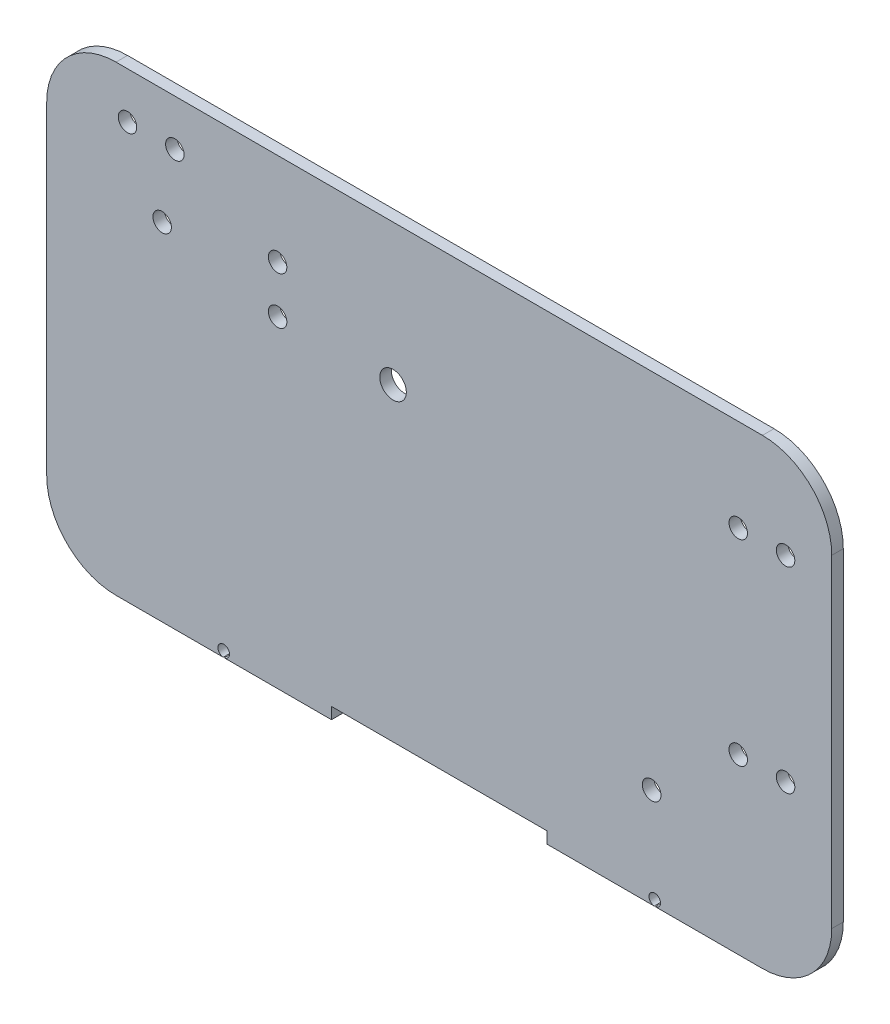
ISO-10303-21;
HEADER;
FILE_DESCRIPTION(('STEP AP214'),'2;1');
FILE_NAME('part.step','',(''),(''),'','','');
FILE_SCHEMA(('AUTOMOTIVE_DESIGN { 1 0 10303 214 1 1 1 1 }'));
ENDSEC;
DATA;
#1=APPLICATION_CONTEXT('core data for automotive mechanical design processes');
#2=APPLICATION_PROTOCOL_DEFINITION('international standard','automotive_design',2000,#1);
#3=PRODUCT_CONTEXT('',#1,'mechanical');
#4=PRODUCT('Part','Part','',(#3));
#5=PRODUCT_RELATED_PRODUCT_CATEGORY('part','',(#4));
#6=PRODUCT_DEFINITION_FORMATION('','',#4);
#7=PRODUCT_DEFINITION_CONTEXT('part definition',#1,'design');
#8=PRODUCT_DEFINITION('design','',#6,#7);
#9=PRODUCT_DEFINITION_SHAPE('','',#8);
#10=(LENGTH_UNIT() NAMED_UNIT(*) SI_UNIT(.MILLI.,.METRE.));
#11=(NAMED_UNIT(*) PLANE_ANGLE_UNIT() SI_UNIT($,.RADIAN.));
#12=(NAMED_UNIT(*) SI_UNIT($,.STERADIAN.) SOLID_ANGLE_UNIT());
#13=UNCERTAINTY_MEASURE_WITH_UNIT(LENGTH_MEASURE(1.E-05),#10,'distance_accuracy_value','');
#14=(GEOMETRIC_REPRESENTATION_CONTEXT(3) GLOBAL_UNCERTAINTY_ASSIGNED_CONTEXT((#13)) GLOBAL_UNIT_ASSIGNED_CONTEXT((#10,
#11,#12)) REPRESENTATION_CONTEXT('',''));
#15=CARTESIAN_POINT('',(0.,0.,0.));
#16=DIRECTION('',(0.,0.,1.));
#17=DIRECTION('',(1.,0.,0.));
#18=AXIS2_PLACEMENT_3D('',#15,#16,#17);
#19=CARTESIAN_POINT('',(-125.47242970477,-88.332065652522,5.));
#20=DIRECTION('',(0.,1.,0.));
#21=DIRECTION('',(0.,0.,1.));
#22=AXIS2_PLACEMENT_3D('',#19,#20,#21);
#23=PLANE('',#22);
#24=DIRECTION('',(1.,0.,0.));
#25=VECTOR('',#24,1.);
#26=CARTESIAN_POINT('',(-125.47242970477,-88.332065652522,0.));
#27=LINE('',#26,#25);
#28=CARTESIAN_POINT('',(61.1942369618966,-88.332065652522,0.));
#29=VERTEX_POINT('',#28);
#30=CARTESIAN_POINT('',(107.637520549526,-88.332065652522,0.));
#31=VERTEX_POINT('',#30);
#32=EDGE_CURVE('E157',#29,#31,#27,.T.);
#33=ORIENTED_EDGE('',*,*,#32,.T.);
#34=DIRECTION('',(0.,0.,1.));
#35=VECTOR('',#34,1.);
#36=CARTESIAN_POINT('',(107.637520549526,-88.332065652522,-5.));
#37=LINE('',#36,#35);
#38=CARTESIAN_POINT('',(107.637520549526,-88.332065652522,5.));
#39=VERTEX_POINT('',#38);
#40=EDGE_CURVE('E11',#31,#39,#37,.T.);
#41=ORIENTED_EDGE('',*,*,#40,.T.);
#42=DIRECTION('',(1.,0.,0.));
#43=VECTOR('',#42,1.);
#44=CARTESIAN_POINT('',(-125.47242970477,-88.332065652522,5.));
#45=LINE('',#44,#43);
#46=CARTESIAN_POINT('',(61.1942369618966,-88.332065652522,5.));
#47=VERTEX_POINT('',#46);
#48=EDGE_CURVE('E155',#47,#39,#45,.T.);
#49=ORIENTED_EDGE('',*,*,#48,.F.);
#50=DIRECTION('',(0.,0.,1.));
#51=VECTOR('',#50,1.);
#52=CARTESIAN_POINT('',(61.1942369618966,-88.332065652522,5.));
#53=LINE('',#52,#51);
#54=EDGE_CURVE('E236',#29,#47,#53,.T.);
#55=ORIENTED_EDGE('',*,*,#54,.F.);
#56=EDGE_LOOP('',(#33,#41,#49,#55));
#57=FACE_BOUND('',#56,.T.);
#58=ADVANCED_FACE('F34',(#57),#23,.F.);
#59=CARTESIAN_POINT('',(-125.47242970477,-88.332065652522,0.));
#60=VERTEX_POINT('',#59);
#61=CARTESIAN_POINT('',(-79.02914611714,-88.332065652522,0.));
#62=VERTEX_POINT('',#61);
#63=EDGE_CURVE('E194',#60,#62,#27,.T.);
#64=ORIENTED_EDGE('',*,*,#63,.T.);
#65=DIRECTION('',(0.,0.,1.));
#66=VECTOR('',#65,1.);
#67=CARTESIAN_POINT('',(-79.02914611714,-88.332065652522,-5.));
#68=LINE('',#67,#66);
#69=CARTESIAN_POINT('',(-79.02914611714,-88.332065652522,5.));
#70=VERTEX_POINT('',#69);
#71=EDGE_CURVE('E242',#62,#70,#68,.T.);
#72=ORIENTED_EDGE('',*,*,#71,.T.);
#73=CARTESIAN_POINT('',(-125.47242970477,-88.332065652522,5.));
#74=VERTEX_POINT('',#73);
#75=EDGE_CURVE('E167',#74,#70,#45,.T.);
#76=ORIENTED_EDGE('',*,*,#75,.F.);
#77=DIRECTION('',(0.,0.,-1.));
#78=VECTOR('',#77,1.);
#79=CARTESIAN_POINT('',(-125.47242970477,-88.332065652522,5.));
#80=LINE('',#79,#78);
#81=EDGE_CURVE('E230',#74,#60,#80,.T.);
#82=ORIENTED_EDGE('',*,*,#81,.T.);
#83=EDGE_LOOP('',(#64,#72,#76,#82));
#84=FACE_BOUND('',#83,.T.);
#85=ADVANCED_FACE('F346',(#84),#23,.F.);
#86=CARTESIAN_POINT('',(-125.47242970477,-58.332065652522,5.));
#87=DIRECTION('',(0.,0.,1.));
#88=DIRECTION('',(1.,0.,0.));
#89=AXIS2_PLACEMENT_3D('',#86,#87,#88);
#90=PLANE('',#89);
#91=CARTESIAN_POINT('',(107.860903628563,-85.842065652522,5.));
#92=DIRECTION('',(0.,0.,1.));
#93=DIRECTION('',(-1.,0.,0.));
#94=AXIS2_PLACEMENT_3D('',#91,#92,#93);
#95=CIRCLE('',#94,2.5);
#96=CARTESIAN_POINT('',(108.0842867076,-88.332065652522,5.));
#97=VERTEX_POINT('',#96);
#98=EDGE_CURVE('E145',#97,#39,#95,.T.);
#99=ORIENTED_EDGE('',*,*,#98,.F.);
#100=CARTESIAN_POINT('',(154.52757029523,-88.332065652522,5.));
#101=VERTEX_POINT('',#100);
#102=EDGE_CURVE('E165',#97,#101,#45,.T.);
#103=ORIENTED_EDGE('',*,*,#102,.T.);
#104=CARTESIAN_POINT('',(154.52757029523,-58.332065652522,5.));
#105=DIRECTION('',(0.,0.,1.));
#106=DIRECTION('',(1.,0.,0.));
#107=AXIS2_PLACEMENT_3D('',#104,#105,#106);
#108=CIRCLE('',#107,30.);
#109=CARTESIAN_POINT('',(184.52757029523,-58.332065652522,5.));
#110=VERTEX_POINT('',#109);
#111=EDGE_CURVE('E172',#101,#110,#108,.T.);
#112=ORIENTED_EDGE('',*,*,#111,.T.);
#113=DIRECTION('',(0.,1.,0.));
#114=VECTOR('',#113,1.);
#115=CARTESIAN_POINT('',(184.52757029523,-58.332065652522,5.));
#116=LINE('',#115,#114);
#117=CARTESIAN_POINT('',(184.52757029523,81.667934347478,5.));
#118=VERTEX_POINT('',#117);
#119=EDGE_CURVE('E175',#110,#118,#116,.T.);
#120=ORIENTED_EDGE('',*,*,#119,.T.);
#121=CARTESIAN_POINT('',(154.52757029523,81.667934347478,5.));
#122=DIRECTION('',(0.,0.,1.));
#123=DIRECTION('',(1.,0.,0.));
#124=AXIS2_PLACEMENT_3D('',#121,#122,#123);
#125=CIRCLE('',#124,30.);
#126=CARTESIAN_POINT('',(154.52757029523,111.667934347478,5.));
#127=VERTEX_POINT('',#126);
#128=EDGE_CURVE('E178',#118,#127,#125,.T.);
#129=ORIENTED_EDGE('',*,*,#128,.T.);
#130=DIRECTION('',(-1.,0.,0.));
#131=VECTOR('',#130,1.);
#132=CARTESIAN_POINT('',(154.52757029523,111.667934347478,5.));
#133=LINE('',#132,#131);
#134=CARTESIAN_POINT('',(-125.47242970477,111.667934347478,5.));
#135=VERTEX_POINT('',#134);
#136=EDGE_CURVE('E182',#127,#135,#133,.T.);
#137=ORIENTED_EDGE('',*,*,#136,.T.);
#138=CARTESIAN_POINT('',(-125.47242970477,81.667934347478,5.));
#139=DIRECTION('',(0.,0.,1.));
#140=DIRECTION('',(1.,0.,0.));
#141=AXIS2_PLACEMENT_3D('',#138,#139,#140);
#142=CIRCLE('',#141,30.);
#143=CARTESIAN_POINT('',(-155.47242970477,81.667934347478,5.));
#144=VERTEX_POINT('',#143);
#145=EDGE_CURVE('E184',#135,#144,#142,.T.);
#146=ORIENTED_EDGE('',*,*,#145,.T.);
#147=DIRECTION('',(0.,-1.,0.));
#148=VECTOR('',#147,1.);
#149=CARTESIAN_POINT('',(-155.47242970477,81.667934347478,5.));
#150=LINE('',#149,#148);
#151=CARTESIAN_POINT('',(-155.47242970477,-58.3320656525218,5.));
#152=VERTEX_POINT('',#151);
#153=EDGE_CURVE('E186',#144,#152,#150,.T.);
#154=ORIENTED_EDGE('',*,*,#153,.T.);
#155=CARTESIAN_POINT('',(-125.47242970477,-58.332065652522,5.));
#156=DIRECTION('',(0.,0.,1.));
#157=DIRECTION('',(1.,0.,0.));
#158=AXIS2_PLACEMENT_3D('',#155,#156,#157);
#159=CIRCLE('',#158,30.);
#160=EDGE_CURVE('E168',#152,#74,#159,.T.);
#161=ORIENTED_EDGE('',*,*,#160,.T.);
#162=ORIENTED_EDGE('',*,*,#75,.T.);
#163=CARTESIAN_POINT('',(-78.8057630381032,-85.842065652522,5.));
#164=DIRECTION('',(0.,0.,1.));
#165=DIRECTION('',(1.,0.,0.));
#166=AXIS2_PLACEMENT_3D('',#163,#164,#165);
#167=CIRCLE('',#166,2.5);
#168=CARTESIAN_POINT('',(-78.5823799590665,-88.332065652522,5.));
#169=VERTEX_POINT('',#168);
#170=EDGE_CURVE('E348',#169,#70,#167,.T.);
#171=ORIENTED_EDGE('',*,*,#170,.F.);
#172=CARTESIAN_POINT('',(-32.1390963714366,-88.332065652522,5.));
#173=VERTEX_POINT('',#172);
#174=EDGE_CURVE('E164',#169,#173,#45,.T.);
#175=ORIENTED_EDGE('',*,*,#174,.T.);
#176=DIRECTION('',(0.,-1.,0.));
#177=VECTOR('',#176,1.);
#178=CARTESIAN_POINT('',(-32.1390963714366,0.,5.));
#179=LINE('',#178,#177);
#180=CARTESIAN_POINT('',(-32.1390963714366,-83.332065652522,5.));
#181=VERTEX_POINT('',#180);
#182=EDGE_CURVE('E264',#181,#173,#179,.T.);
#183=ORIENTED_EDGE('',*,*,#182,.F.);
#184=DIRECTION('',(1.,0.,0.));
#185=VECTOR('',#184,1.);
#186=CARTESIAN_POINT('',(0.,-83.332065652522,5.));
#187=LINE('',#186,#185);
#188=CARTESIAN_POINT('',(61.1942369618966,-83.332065652522,5.));
#189=VERTEX_POINT('',#188);
#190=EDGE_CURVE('E350',#181,#189,#187,.T.);
#191=ORIENTED_EDGE('',*,*,#190,.T.);
#192=DIRECTION('',(0.,-1.,0.));
#193=VECTOR('',#192,1.);
#194=CARTESIAN_POINT('',(61.1942369618966,0.,5.));
#195=LINE('',#194,#193);
#196=EDGE_CURVE('E163',#189,#47,#195,.T.);
#197=ORIENTED_EDGE('',*,*,#196,.T.);
#198=ORIENTED_EDGE('',*,*,#48,.T.);
#199=EDGE_LOOP('',(#99,#103,#112,#120,#129,#137,#146,#154,#161,#162,#171,#175,#183,#191,#197,#198));
#200=FACE_BOUND('',#199,.T.);
#201=CARTESIAN_POINT('',(-5.47242970477013,50.667934347478,5.));
#202=DIRECTION('',(0.,0.,1.));
#203=DIRECTION('',(1.,0.,0.));
#204=AXIS2_PLACEMENT_3D('',#201,#202,#203);
#205=CIRCLE('',#204,5.75);
#206=CARTESIAN_POINT('',(0.27757029522987,50.667934347478,5.));
#207=VERTEX_POINT('',#206);
#208=EDGE_CURVE('E282',#207,#207,#205,.T.);
#209=ORIENTED_EDGE('',*,*,#208,.F.);
#210=EDGE_LOOP('',(#209));
#211=FACE_BOUND('',#210,.T.);
#212=CARTESIAN_POINT('',(-99.9724297047701,91.667934347478,5.));
#213=DIRECTION('',(0.,0.,1.));
#214=DIRECTION('',(1.,0.,0.));
#215=AXIS2_PLACEMENT_3D('',#212,#213,#214);
#216=CIRCLE('',#215,3.99999999999999);
#217=CARTESIAN_POINT('',(-95.9724297047701,91.667934347478,5.));
#218=VERTEX_POINT('',#217);
#219=EDGE_CURVE('E294',#218,#218,#216,.T.);
#220=ORIENTED_EDGE('',*,*,#219,.F.);
#221=EDGE_LOOP('',(#220));
#222=FACE_BOUND('',#221,.T.);
#223=CARTESIAN_POINT('',(144.02757029523,71.667934347478,5.));
#224=DIRECTION('',(0.,0.,1.));
#225=DIRECTION('',(1.,0.,0.));
#226=AXIS2_PLACEMENT_3D('',#223,#224,#225);
#227=CIRCLE('',#226,3.99999999999999);
#228=CARTESIAN_POINT('',(148.02757029523,71.667934347478,5.));
#229=VERTEX_POINT('',#228);
#230=EDGE_CURVE('E306',#229,#229,#227,.T.);
#231=ORIENTED_EDGE('',*,*,#230,.F.);
#232=EDGE_LOOP('',(#231));
#233=FACE_BOUND('',#232,.T.);
#234=CARTESIAN_POINT('',(144.02757029523,-13.332065652522,5.));
#235=DIRECTION('',(0.,0.,1.));
#236=DIRECTION('',(1.,0.,0.));
#237=AXIS2_PLACEMENT_3D('',#234,#235,#236);
#238=CIRCLE('',#237,3.99999999999999);
#239=CARTESIAN_POINT('',(148.02757029523,-13.332065652522,5.));
#240=VERTEX_POINT('',#239);
#241=EDGE_CURVE('E318',#240,#240,#238,.T.);
#242=ORIENTED_EDGE('',*,*,#241,.F.);
#243=EDGE_LOOP('',(#242));
#244=FACE_BOUND('',#243,.T.);
#245=CARTESIAN_POINT('',(-55.4724297047701,71.667934347478,5.));
#246=DIRECTION('',(0.,0.,1.));
#247=DIRECTION('',(1.,0.,0.));
#248=AXIS2_PLACEMENT_3D('',#245,#246,#247);
#249=CIRCLE('',#248,4.00000000000001);
#250=CARTESIAN_POINT('',(-51.4724297047701,71.667934347478,5.));
#251=VERTEX_POINT('',#250);
#252=EDGE_CURVE('E330',#251,#251,#249,.T.);
#253=ORIENTED_EDGE('',*,*,#252,.F.);
#254=EDGE_LOOP('',(#253));
#255=FACE_BOUND('',#254,.T.);
#256=CARTESIAN_POINT('',(-105.47242970477,61.667934347478,5.));
#257=DIRECTION('',(0.,0.,1.));
#258=DIRECTION('',(1.,0.,0.));
#259=AXIS2_PLACEMENT_3D('',#256,#257,#258);
#260=CIRCLE('',#259,4.00000000000001);
#261=CARTESIAN_POINT('',(-101.47242970477,61.667934347478,5.));
#262=VERTEX_POINT('',#261);
#263=EDGE_CURVE('E193',#262,#262,#260,.T.);
#264=ORIENTED_EDGE('',*,*,#263,.F.);
#265=EDGE_LOOP('',(#264));
#266=FACE_BOUND('',#265,.T.);
#267=CARTESIAN_POINT('',(-55.4724297047701,51.167934347478,5.));
#268=DIRECTION('',(0.,0.,1.));
#269=DIRECTION('',(1.,0.,0.));
#270=AXIS2_PLACEMENT_3D('',#267,#268,#269);
#271=CIRCLE('',#270,4.00000000000001);
#272=CARTESIAN_POINT('',(-51.4724297047701,51.167934347478,5.));
#273=VERTEX_POINT('',#272);
#274=EDGE_CURVE('E324',#273,#273,#271,.T.);
#275=ORIENTED_EDGE('',*,*,#274,.F.);
#276=EDGE_LOOP('',(#275));
#277=FACE_BOUND('',#276,.T.);
#278=CARTESIAN_POINT('',(164.52757029523,-13.332065652522,5.));
#279=DIRECTION('',(0.,0.,1.));
#280=DIRECTION('',(1.,0.,0.));
#281=AXIS2_PLACEMENT_3D('',#278,#279,#280);
#282=CIRCLE('',#281,3.99999999999999);
#283=CARTESIAN_POINT('',(168.52757029523,-13.332065652522,5.));
#284=VERTEX_POINT('',#283);
#285=EDGE_CURVE('E312',#284,#284,#282,.T.);
#286=ORIENTED_EDGE('',*,*,#285,.F.);
#287=EDGE_LOOP('',(#286));
#288=FACE_BOUND('',#287,.T.);
#289=CARTESIAN_POINT('',(164.52757029523,71.667934347478,5.));
#290=DIRECTION('',(0.,0.,1.));
#291=DIRECTION('',(1.,0.,0.));
#292=AXIS2_PLACEMENT_3D('',#289,#290,#291);
#293=CIRCLE('',#292,3.99999999999999);
#294=CARTESIAN_POINT('',(168.52757029523,71.667934347478,5.));
#295=VERTEX_POINT('',#294);
#296=EDGE_CURVE('E300',#295,#295,#293,.T.);
#297=ORIENTED_EDGE('',*,*,#296,.F.);
#298=EDGE_LOOP('',(#297));
#299=FACE_BOUND('',#298,.T.);
#300=CARTESIAN_POINT('',(-120.47242970477,91.667934347478,5.));
#301=DIRECTION('',(0.,0.,1.));
#302=DIRECTION('',(1.,0.,0.));
#303=AXIS2_PLACEMENT_3D('',#300,#301,#302);
#304=CIRCLE('',#303,3.99999999999999);
#305=CARTESIAN_POINT('',(-116.47242970477,91.667934347478,5.));
#306=VERTEX_POINT('',#305);
#307=EDGE_CURVE('E288',#306,#306,#304,.T.);
#308=ORIENTED_EDGE('',*,*,#307,.F.);
#309=EDGE_LOOP('',(#308));
#310=FACE_BOUND('',#309,.T.);
#311=CARTESIAN_POINT('',(106.52757029523,-45.332065652522,5.));
#312=DIRECTION('',(0.,0.,1.));
#313=DIRECTION('',(1.,0.,0.));
#314=AXIS2_PLACEMENT_3D('',#311,#312,#313);
#315=CIRCLE('',#314,4.05);
#316=CARTESIAN_POINT('',(110.57757029523,-45.332065652522,5.));
#317=VERTEX_POINT('',#316);
#318=EDGE_CURVE('E276',#317,#317,#315,.T.);
#319=ORIENTED_EDGE('',*,*,#318,.F.);
#320=EDGE_LOOP('',(#319));
#321=FACE_BOUND('',#320,.T.);
#322=ADVANCED_FACE('F159',(#200,#211,#222,#233,#244,#255,#266,#277,#288,#299,#310,#321),#90,.T.);
#323=CARTESIAN_POINT('',(-125.47242970477,-58.332065652522,0.));
#324=DIRECTION('',(0.,0.,1.));
#325=DIRECTION('',(1.,0.,0.));
#326=AXIS2_PLACEMENT_3D('',#323,#324,#325);
#327=PLANE('',#326);
#328=CARTESIAN_POINT('',(106.52757029523,-45.332065652522,0.));
#329=DIRECTION('',(0.,0.,1.));
#330=DIRECTION('',(1.,0.,0.));
#331=AXIS2_PLACEMENT_3D('',#328,#329,#330);
#332=CIRCLE('',#331,4.05);
#333=CARTESIAN_POINT('',(110.57757029523,-45.332065652522,0.));
#334=VERTEX_POINT('',#333);
#335=EDGE_CURVE('E270',#334,#334,#332,.T.);
#336=ORIENTED_EDGE('',*,*,#335,.T.);
#337=EDGE_LOOP('',(#336));
#338=FACE_BOUND('',#337,.T.);
#339=CARTESIAN_POINT('',(-5.47242970477013,50.667934347478,0.));
#340=DIRECTION('',(0.,0.,1.));
#341=DIRECTION('',(1.,0.,0.));
#342=AXIS2_PLACEMENT_3D('',#339,#340,#341);
#343=CIRCLE('',#342,5.75);
#344=CARTESIAN_POINT('',(0.27757029522987,50.667934347478,0.));
#345=VERTEX_POINT('',#344);
#346=EDGE_CURVE('E279',#345,#345,#343,.T.);
#347=ORIENTED_EDGE('',*,*,#346,.T.);
#348=EDGE_LOOP('',(#347));
#349=FACE_BOUND('',#348,.T.);
#350=CARTESIAN_POINT('',(-120.47242970477,91.667934347478,0.));
#351=DIRECTION('',(0.,0.,1.));
#352=DIRECTION('',(1.,0.,0.));
#353=AXIS2_PLACEMENT_3D('',#350,#351,#352);
#354=CIRCLE('',#353,3.99999999999999);
#355=CARTESIAN_POINT('',(-116.47242970477,91.667934347478,0.));
#356=VERTEX_POINT('',#355);
#357=EDGE_CURVE('E285',#356,#356,#354,.T.);
#358=ORIENTED_EDGE('',*,*,#357,.T.);
#359=EDGE_LOOP('',(#358));
#360=FACE_BOUND('',#359,.T.);
#361=CARTESIAN_POINT('',(-99.9724297047701,91.667934347478,0.));
#362=DIRECTION('',(0.,0.,1.));
#363=DIRECTION('',(1.,0.,0.));
#364=AXIS2_PLACEMENT_3D('',#361,#362,#363);
#365=CIRCLE('',#364,3.99999999999999);
#366=CARTESIAN_POINT('',(-95.9724297047701,91.667934347478,0.));
#367=VERTEX_POINT('',#366);
#368=EDGE_CURVE('E291',#367,#367,#365,.T.);
#369=ORIENTED_EDGE('',*,*,#368,.T.);
#370=EDGE_LOOP('',(#369));
#371=FACE_BOUND('',#370,.T.);
#372=CARTESIAN_POINT('',(164.52757029523,71.667934347478,0.));
#373=DIRECTION('',(0.,0.,1.));
#374=DIRECTION('',(1.,0.,0.));
#375=AXIS2_PLACEMENT_3D('',#372,#373,#374);
#376=CIRCLE('',#375,3.99999999999999);
#377=CARTESIAN_POINT('',(168.52757029523,71.667934347478,0.));
#378=VERTEX_POINT('',#377);
#379=EDGE_CURVE('E297',#378,#378,#376,.T.);
#380=ORIENTED_EDGE('',*,*,#379,.T.);
#381=EDGE_LOOP('',(#380));
#382=FACE_BOUND('',#381,.T.);
#383=CARTESIAN_POINT('',(144.02757029523,71.667934347478,0.));
#384=DIRECTION('',(0.,0.,1.));
#385=DIRECTION('',(1.,0.,0.));
#386=AXIS2_PLACEMENT_3D('',#383,#384,#385);
#387=CIRCLE('',#386,3.99999999999999);
#388=CARTESIAN_POINT('',(148.02757029523,71.667934347478,0.));
#389=VERTEX_POINT('',#388);
#390=EDGE_CURVE('E303',#389,#389,#387,.T.);
#391=ORIENTED_EDGE('',*,*,#390,.T.);
#392=EDGE_LOOP('',(#391));
#393=FACE_BOUND('',#392,.T.);
#394=CARTESIAN_POINT('',(164.52757029523,-13.332065652522,0.));
#395=DIRECTION('',(0.,0.,1.));
#396=DIRECTION('',(1.,0.,0.));
#397=AXIS2_PLACEMENT_3D('',#394,#395,#396);
#398=CIRCLE('',#397,3.99999999999999);
#399=CARTESIAN_POINT('',(168.52757029523,-13.332065652522,0.));
#400=VERTEX_POINT('',#399);
#401=EDGE_CURVE('E309',#400,#400,#398,.T.);
#402=ORIENTED_EDGE('',*,*,#401,.T.);
#403=EDGE_LOOP('',(#402));
#404=FACE_BOUND('',#403,.T.);
#405=CARTESIAN_POINT('',(144.02757029523,-13.332065652522,0.));
#406=DIRECTION('',(0.,0.,1.));
#407=DIRECTION('',(1.,0.,0.));
#408=AXIS2_PLACEMENT_3D('',#405,#406,#407);
#409=CIRCLE('',#408,3.99999999999999);
#410=CARTESIAN_POINT('',(148.02757029523,-13.332065652522,0.));
#411=VERTEX_POINT('',#410);
#412=EDGE_CURVE('E315',#411,#411,#409,.T.);
#413=ORIENTED_EDGE('',*,*,#412,.T.);
#414=EDGE_LOOP('',(#413));
#415=FACE_BOUND('',#414,.T.);
#416=CARTESIAN_POINT('',(-55.4724297047701,51.167934347478,0.));
#417=DIRECTION('',(0.,0.,1.));
#418=DIRECTION('',(1.,0.,0.));
#419=AXIS2_PLACEMENT_3D('',#416,#417,#418);
#420=CIRCLE('',#419,4.00000000000001);
#421=CARTESIAN_POINT('',(-51.4724297047701,51.167934347478,0.));
#422=VERTEX_POINT('',#421);
#423=EDGE_CURVE('E321',#422,#422,#420,.T.);
#424=ORIENTED_EDGE('',*,*,#423,.T.);
#425=EDGE_LOOP('',(#424));
#426=FACE_BOUND('',#425,.T.);
#427=CARTESIAN_POINT('',(-55.4724297047701,71.667934347478,0.));
#428=DIRECTION('',(0.,0.,1.));
#429=DIRECTION('',(1.,0.,0.));
#430=AXIS2_PLACEMENT_3D('',#427,#428,#429);
#431=CIRCLE('',#430,4.00000000000001);
#432=CARTESIAN_POINT('',(-51.4724297047701,71.667934347478,0.));
#433=VERTEX_POINT('',#432);
#434=EDGE_CURVE('E327',#433,#433,#431,.T.);
#435=ORIENTED_EDGE('',*,*,#434,.T.);
#436=EDGE_LOOP('',(#435));
#437=FACE_BOUND('',#436,.T.);
#438=CARTESIAN_POINT('',(-105.47242970477,61.667934347478,0.));
#439=DIRECTION('',(0.,0.,1.));
#440=DIRECTION('',(1.,0.,0.));
#441=AXIS2_PLACEMENT_3D('',#438,#439,#440);
#442=CIRCLE('',#441,4.00000000000001);
#443=CARTESIAN_POINT('',(-101.47242970477,61.667934347478,0.));
#444=VERTEX_POINT('',#443);
#445=EDGE_CURVE('E333',#444,#444,#442,.T.);
#446=ORIENTED_EDGE('',*,*,#445,.T.);
#447=EDGE_LOOP('',(#446));
#448=FACE_BOUND('',#447,.T.);
#449=CARTESIAN_POINT('',(108.0842867076,-88.332065652522,0.));
#450=VERTEX_POINT('',#449);
#451=CARTESIAN_POINT('',(154.52757029523,-88.332065652522,0.));
#452=VERTEX_POINT('',#451);
#453=EDGE_CURVE('E192',#450,#452,#27,.T.);
#454=ORIENTED_EDGE('',*,*,#453,.F.);
#455=CARTESIAN_POINT('',(107.860903628563,-85.842065652522,0.));
#456=DIRECTION('',(0.,0.,1.));
#457=DIRECTION('',(1.,0.,0.));
#458=AXIS2_PLACEMENT_3D('',#455,#456,#457);
#459=CIRCLE('',#458,2.5);
#460=EDGE_CURVE('E49',#450,#31,#459,.T.);
#461=ORIENTED_EDGE('',*,*,#460,.T.);
#462=ORIENTED_EDGE('',*,*,#32,.F.);
#463=DIRECTION('',(0.,-1.,0.));
#464=VECTOR('',#463,1.);
#465=CARTESIAN_POINT('',(61.1942369618966,-58.332065652522,0.));
#466=LINE('',#465,#464);
#467=CARTESIAN_POINT('',(61.1942369618966,-83.332065652522,0.));
#468=VERTEX_POINT('',#467);
#469=EDGE_CURVE('E267',#468,#29,#466,.T.);
#470=ORIENTED_EDGE('',*,*,#469,.F.);
#471=DIRECTION('',(1.,0.,0.));
#472=VECTOR('',#471,1.);
#473=CARTESIAN_POINT('',(-125.47242970477,-83.332065652522,0.));
#474=LINE('',#473,#472);
#475=CARTESIAN_POINT('',(-32.1390963714366,-83.332065652522,0.));
#476=VERTEX_POINT('',#475);
#477=EDGE_CURVE('E238',#476,#468,#474,.T.);
#478=ORIENTED_EDGE('',*,*,#477,.F.);
#479=DIRECTION('',(0.,-1.,0.));
#480=VECTOR('',#479,1.);
#481=CARTESIAN_POINT('',(-32.1390963714366,-58.332065652522,0.));
#482=LINE('',#481,#480);
#483=CARTESIAN_POINT('',(-32.1390963714366,-88.332065652522,0.));
#484=VERTEX_POINT('',#483);
#485=EDGE_CURVE('E261',#476,#484,#482,.T.);
#486=ORIENTED_EDGE('',*,*,#485,.T.);
#487=CARTESIAN_POINT('',(-78.5823799590665,-88.332065652522,0.));
#488=VERTEX_POINT('',#487);
#489=EDGE_CURVE('E198',#488,#484,#27,.T.);
#490=ORIENTED_EDGE('',*,*,#489,.F.);
#491=CARTESIAN_POINT('',(-78.8057630381032,-85.842065652522,0.));
#492=DIRECTION('',(0.,0.,1.));
#493=DIRECTION('',(1.,0.,0.));
#494=AXIS2_PLACEMENT_3D('',#491,#492,#493);
#495=CIRCLE('',#494,2.5);
#496=EDGE_CURVE('E57',#488,#62,#495,.T.);
#497=ORIENTED_EDGE('',*,*,#496,.T.);
#498=ORIENTED_EDGE('',*,*,#63,.F.);
#499=CARTESIAN_POINT('',(-125.47242970477,-58.332065652522,0.));
#500=DIRECTION('',(0.,0.,1.));
#501=DIRECTION('',(1.,0.,0.));
#502=AXIS2_PLACEMENT_3D('',#499,#500,#501);
#503=CIRCLE('',#502,30.);
#504=CARTESIAN_POINT('',(-155.47242970477,-58.3320656525218,0.));
#505=VERTEX_POINT('',#504);
#506=EDGE_CURVE('E189',#505,#60,#503,.T.);
#507=ORIENTED_EDGE('',*,*,#506,.F.);
#508=DIRECTION('',(0.,-1.,0.));
#509=VECTOR('',#508,1.);
#510=CARTESIAN_POINT('',(-155.47242970477,81.667934347478,0.));
#511=LINE('',#510,#509);
#512=CARTESIAN_POINT('',(-155.47242970477,81.667934347478,0.));
#513=VERTEX_POINT('',#512);
#514=EDGE_CURVE('E208',#513,#505,#511,.T.);
#515=ORIENTED_EDGE('',*,*,#514,.F.);
#516=CARTESIAN_POINT('',(-125.47242970477,81.667934347478,0.));
#517=DIRECTION('',(0.,0.,1.));
#518=DIRECTION('',(1.,0.,0.));
#519=AXIS2_PLACEMENT_3D('',#516,#517,#518);
#520=CIRCLE('',#519,30.);
#521=CARTESIAN_POINT('',(-125.47242970477,111.667934347478,0.));
#522=VERTEX_POINT('',#521);
#523=EDGE_CURVE('E206',#522,#513,#520,.T.);
#524=ORIENTED_EDGE('',*,*,#523,.F.);
#525=DIRECTION('',(-1.,0.,0.));
#526=VECTOR('',#525,1.);
#527=CARTESIAN_POINT('',(154.52757029523,111.667934347478,0.));
#528=LINE('',#527,#526);
#529=CARTESIAN_POINT('',(154.52757029523,111.667934347478,0.));
#530=VERTEX_POINT('',#529);
#531=EDGE_CURVE('E204',#530,#522,#528,.T.);
#532=ORIENTED_EDGE('',*,*,#531,.F.);
#533=CARTESIAN_POINT('',(154.52757029523,81.667934347478,0.));
#534=DIRECTION('',(0.,0.,1.));
#535=DIRECTION('',(1.,0.,0.));
#536=AXIS2_PLACEMENT_3D('',#533,#534,#535);
#537=CIRCLE('',#536,30.);
#538=CARTESIAN_POINT('',(184.52757029523,81.667934347478,0.));
#539=VERTEX_POINT('',#538);
#540=EDGE_CURVE('E202',#539,#530,#537,.T.);
#541=ORIENTED_EDGE('',*,*,#540,.F.);
#542=DIRECTION('',(0.,1.,0.));
#543=VECTOR('',#542,1.);
#544=CARTESIAN_POINT('',(184.52757029523,-58.332065652522,0.));
#545=LINE('',#544,#543);
#546=CARTESIAN_POINT('',(184.52757029523,-58.332065652522,0.));
#547=VERTEX_POINT('',#546);
#548=EDGE_CURVE('E200',#547,#539,#545,.T.);
#549=ORIENTED_EDGE('',*,*,#548,.F.);
#550=CARTESIAN_POINT('',(154.52757029523,-58.332065652522,0.));
#551=DIRECTION('',(0.,0.,1.));
#552=DIRECTION('',(1.,0.,0.));
#553=AXIS2_PLACEMENT_3D('',#550,#551,#552);
#554=CIRCLE('',#553,30.);
#555=EDGE_CURVE('E197',#452,#547,#554,.T.);
#556=ORIENTED_EDGE('',*,*,#555,.F.);
#557=EDGE_LOOP('',(#454,#461,#462,#470,#478,#486,#490,#497,#498,#507,#515,#524,#532,#541,#549,#556));
#558=FACE_BOUND('',#557,.T.);
#559=ADVANCED_FACE('F250',(#338,#349,#360,#371,#382,#393,#404,#415,#426,#437,#448,#558),#327,.F.);
#560=ORIENTED_EDGE('',*,*,#102,.F.);
#561=DIRECTION('',(0.,0.,1.));
#562=VECTOR('',#561,1.);
#563=CARTESIAN_POINT('',(108.0842867076,-88.332065652522,-5.));
#564=LINE('',#563,#562);
#565=EDGE_CURVE('E42',#97,#450,#564,.F.);
#566=ORIENTED_EDGE('',*,*,#565,.T.);
#567=ORIENTED_EDGE('',*,*,#453,.T.);
#568=DIRECTION('',(0.,0.,-1.));
#569=VECTOR('',#568,1.);
#570=CARTESIAN_POINT('',(154.52757029523,-88.332065652522,5.));
#571=LINE('',#570,#569);
#572=EDGE_CURVE('E227',#101,#452,#571,.T.);
#573=ORIENTED_EDGE('',*,*,#572,.F.);
#574=EDGE_LOOP('',(#560,#566,#567,#573));
#575=FACE_BOUND('',#574,.T.);
#576=ADVANCED_FACE('F246',(#575),#23,.F.);
#577=CARTESIAN_POINT('',(-125.47242970477,-58.332065652522,5.));
#578=DIRECTION('',(0.,0.,-1.));
#579=DIRECTION('',(-1.,0.,0.));
#580=AXIS2_PLACEMENT_3D('',#577,#578,#579);
#581=CYLINDRICAL_SURFACE('',#580,30.);
#582=ORIENTED_EDGE('',*,*,#506,.T.);
#583=ORIENTED_EDGE('',*,*,#81,.F.);
#584=ORIENTED_EDGE('',*,*,#160,.F.);
#585=DIRECTION('',(0.,0.,-1.));
#586=VECTOR('',#585,1.);
#587=CARTESIAN_POINT('',(-155.47242970477,-58.3320656525218,5.));
#588=LINE('',#587,#586);
#589=EDGE_CURVE('E188',#152,#505,#588,.T.);
#590=ORIENTED_EDGE('',*,*,#589,.T.);
#591=EDGE_LOOP('',(#582,#583,#584,#590));
#592=FACE_BOUND('',#591,.T.);
#593=ADVANCED_FACE('F36',(#592),#581,.T.);
#594=ORIENTED_EDGE('',*,*,#174,.F.);
#595=DIRECTION('',(0.,0.,1.));
#596=VECTOR('',#595,1.);
#597=CARTESIAN_POINT('',(-78.5823799590665,-88.332065652522,-5.));
#598=LINE('',#597,#596);
#599=EDGE_CURVE('E240',#169,#488,#598,.F.);
#600=ORIENTED_EDGE('',*,*,#599,.T.);
#601=ORIENTED_EDGE('',*,*,#489,.T.);
#602=DIRECTION('',(0.,0.,1.));
#603=VECTOR('',#602,1.);
#604=CARTESIAN_POINT('',(-32.1390963714366,-88.332065652522,5.));
#605=LINE('',#604,#603);
#606=EDGE_CURVE('E233',#484,#173,#605,.T.);
#607=ORIENTED_EDGE('',*,*,#606,.T.);
#608=EDGE_LOOP('',(#594,#600,#601,#607));
#609=FACE_BOUND('',#608,.T.);
#610=ADVANCED_FACE('F256',(#609),#23,.F.);
#611=CARTESIAN_POINT('',(154.52757029523,-58.332065652522,5.));
#612=DIRECTION('',(0.,0.,-1.));
#613=DIRECTION('',(-1.,0.,0.));
#614=AXIS2_PLACEMENT_3D('',#611,#612,#613);
#615=CYLINDRICAL_SURFACE('',#614,30.);
#616=ORIENTED_EDGE('',*,*,#555,.T.);
#617=DIRECTION('',(0.,0.,-1.));
#618=VECTOR('',#617,1.);
#619=CARTESIAN_POINT('',(184.52757029523,-58.332065652522,5.));
#620=LINE('',#619,#618);
#621=EDGE_CURVE('E224',#110,#547,#620,.T.);
#622=ORIENTED_EDGE('',*,*,#621,.F.);
#623=ORIENTED_EDGE('',*,*,#111,.F.);
#624=ORIENTED_EDGE('',*,*,#572,.T.);
#625=EDGE_LOOP('',(#616,#622,#623,#624));
#626=FACE_BOUND('',#625,.T.);
#627=ADVANCED_FACE('F378',(#626),#615,.T.);
#628=CARTESIAN_POINT('',(184.52757029523,-58.332065652522,5.));
#629=DIRECTION('',(-1.,0.,0.));
#630=DIRECTION('',(0.,0.,1.));
#631=AXIS2_PLACEMENT_3D('',#628,#629,#630);
#632=PLANE('',#631);
#633=ORIENTED_EDGE('',*,*,#548,.T.);
#634=DIRECTION('',(0.,0.,-1.));
#635=VECTOR('',#634,1.);
#636=CARTESIAN_POINT('',(184.52757029523,81.667934347478,5.));
#637=LINE('',#636,#635);
#638=EDGE_CURVE('E221',#118,#539,#637,.T.);
#639=ORIENTED_EDGE('',*,*,#638,.F.);
#640=ORIENTED_EDGE('',*,*,#119,.F.);
#641=ORIENTED_EDGE('',*,*,#621,.T.);
#642=EDGE_LOOP('',(#633,#639,#640,#641));
#643=FACE_BOUND('',#642,.T.);
#644=ADVANCED_FACE('F383',(#643),#632,.F.);
#645=CARTESIAN_POINT('',(154.52757029523,81.667934347478,5.));
#646=DIRECTION('',(0.,0.,-1.));
#647=DIRECTION('',(-1.,0.,0.));
#648=AXIS2_PLACEMENT_3D('',#645,#646,#647);
#649=CYLINDRICAL_SURFACE('',#648,30.);
#650=ORIENTED_EDGE('',*,*,#540,.T.);
#651=DIRECTION('',(0.,0.,-1.));
#652=VECTOR('',#651,1.);
#653=CARTESIAN_POINT('',(154.52757029523,111.667934347478,5.));
#654=LINE('',#653,#652);
#655=EDGE_CURVE('E218',#127,#530,#654,.T.);
#656=ORIENTED_EDGE('',*,*,#655,.F.);
#657=ORIENTED_EDGE('',*,*,#128,.F.);
#658=ORIENTED_EDGE('',*,*,#638,.T.);
#659=EDGE_LOOP('',(#650,#656,#657,#658));
#660=FACE_BOUND('',#659,.T.);
#661=ADVANCED_FACE('F410',(#660),#649,.T.);
#662=CARTESIAN_POINT('',(154.52757029523,111.667934347478,5.));
#663=DIRECTION('',(0.,-1.,0.));
#664=DIRECTION('',(1.,0.,0.));
#665=AXIS2_PLACEMENT_3D('',#662,#663,#664);
#666=PLANE('',#665);
#667=ORIENTED_EDGE('',*,*,#531,.T.);
#668=DIRECTION('',(0.,0.,-1.));
#669=VECTOR('',#668,1.);
#670=CARTESIAN_POINT('',(-125.47242970477,111.667934347478,5.));
#671=LINE('',#670,#669);
#672=EDGE_CURVE('E215',#135,#522,#671,.T.);
#673=ORIENTED_EDGE('',*,*,#672,.F.);
#674=ORIENTED_EDGE('',*,*,#136,.F.);
#675=ORIENTED_EDGE('',*,*,#655,.T.);
#676=EDGE_LOOP('',(#667,#673,#674,#675));
#677=FACE_BOUND('',#676,.T.);
#678=ADVANCED_FACE('F406',(#677),#666,.F.);
#679=CARTESIAN_POINT('',(-125.47242970477,81.667934347478,5.));
#680=DIRECTION('',(0.,0.,-1.));
#681=DIRECTION('',(-1.,0.,0.));
#682=AXIS2_PLACEMENT_3D('',#679,#680,#681);
#683=CYLINDRICAL_SURFACE('',#682,30.);
#684=ORIENTED_EDGE('',*,*,#523,.T.);
#685=DIRECTION('',(0.,0.,-1.));
#686=VECTOR('',#685,1.);
#687=CARTESIAN_POINT('',(-155.47242970477,81.667934347478,5.));
#688=LINE('',#687,#686);
#689=EDGE_CURVE('E212',#144,#513,#688,.T.);
#690=ORIENTED_EDGE('',*,*,#689,.F.);
#691=ORIENTED_EDGE('',*,*,#145,.F.);
#692=ORIENTED_EDGE('',*,*,#672,.T.);
#693=EDGE_LOOP('',(#684,#690,#691,#692));
#694=FACE_BOUND('',#693,.T.);
#695=ADVANCED_FACE('F402',(#694),#683,.T.);
#696=CARTESIAN_POINT('',(-155.47242970477,81.667934347478,5.));
#697=DIRECTION('',(1.,0.,0.));
#698=DIRECTION('',(0.,0.,-1.));
#699=AXIS2_PLACEMENT_3D('',#696,#697,#698);
#700=PLANE('',#699);
#701=ORIENTED_EDGE('',*,*,#514,.T.);
#702=ORIENTED_EDGE('',*,*,#589,.F.);
#703=ORIENTED_EDGE('',*,*,#153,.F.);
#704=ORIENTED_EDGE('',*,*,#689,.T.);
#705=EDGE_LOOP('',(#701,#702,#703,#704));
#706=FACE_BOUND('',#705,.T.);
#707=ADVANCED_FACE('F398',(#706),#700,.F.);
#708=CARTESIAN_POINT('',(-105.47242970477,61.667934347478,5.));
#709=DIRECTION('',(0.,0.,-1.));
#710=DIRECTION('',(-1.,0.,0.));
#711=AXIS2_PLACEMENT_3D('',#708,#709,#710);
#712=CYLINDRICAL_SURFACE('',#711,4.00000000000001);
#713=ORIENTED_EDGE('',*,*,#263,.T.);
#714=EDGE_LOOP('',(#713));
#715=FACE_BOUND('',#714,.T.);
#716=ORIENTED_EDGE('',*,*,#445,.F.);
#717=EDGE_LOOP('',(#716));
#718=FACE_BOUND('',#717,.T.);
#719=ADVANCED_FACE('F401',(#715,#718),#712,.F.);
#720=CARTESIAN_POINT('',(-55.4724297047701,71.667934347478,5.));
#721=DIRECTION('',(0.,0.,-1.));
#722=DIRECTION('',(-1.,0.,0.));
#723=AXIS2_PLACEMENT_3D('',#720,#721,#722);
#724=CYLINDRICAL_SURFACE('',#723,4.00000000000001);
#725=ORIENTED_EDGE('',*,*,#252,.T.);
#726=EDGE_LOOP('',(#725));
#727=FACE_BOUND('',#726,.T.);
#728=ORIENTED_EDGE('',*,*,#434,.F.);
#729=EDGE_LOOP('',(#728));
#730=FACE_BOUND('',#729,.T.);
#731=ADVANCED_FACE('F455',(#727,#730),#724,.F.);
#732=CARTESIAN_POINT('',(-55.4724297047701,51.167934347478,5.));
#733=DIRECTION('',(0.,0.,-1.));
#734=DIRECTION('',(-1.,0.,0.));
#735=AXIS2_PLACEMENT_3D('',#732,#733,#734);
#736=CYLINDRICAL_SURFACE('',#735,4.00000000000001);
#737=ORIENTED_EDGE('',*,*,#274,.T.);
#738=EDGE_LOOP('',(#737));
#739=FACE_BOUND('',#738,.T.);
#740=ORIENTED_EDGE('',*,*,#423,.F.);
#741=EDGE_LOOP('',(#740));
#742=FACE_BOUND('',#741,.T.);
#743=ADVANCED_FACE('F462',(#739,#742),#736,.F.);
#744=CARTESIAN_POINT('',(144.02757029523,-13.332065652522,5.));
#745=DIRECTION('',(0.,0.,-1.));
#746=DIRECTION('',(-1.,0.,0.));
#747=AXIS2_PLACEMENT_3D('',#744,#745,#746);
#748=CYLINDRICAL_SURFACE('',#747,3.99999999999999);
#749=ORIENTED_EDGE('',*,*,#241,.T.);
#750=EDGE_LOOP('',(#749));
#751=FACE_BOUND('',#750,.T.);
#752=ORIENTED_EDGE('',*,*,#412,.F.);
#753=EDGE_LOOP('',(#752));
#754=FACE_BOUND('',#753,.T.);
#755=ADVANCED_FACE('F470',(#751,#754),#748,.F.);
#756=CARTESIAN_POINT('',(164.52757029523,-13.332065652522,5.));
#757=DIRECTION('',(0.,0.,-1.));
#758=DIRECTION('',(-1.,0.,0.));
#759=AXIS2_PLACEMENT_3D('',#756,#757,#758);
#760=CYLINDRICAL_SURFACE('',#759,3.99999999999999);
#761=ORIENTED_EDGE('',*,*,#285,.T.);
#762=EDGE_LOOP('',(#761));
#763=FACE_BOUND('',#762,.T.);
#764=ORIENTED_EDGE('',*,*,#401,.F.);
#765=EDGE_LOOP('',(#764));
#766=FACE_BOUND('',#765,.T.);
#767=ADVANCED_FACE('F478',(#763,#766),#760,.F.);
#768=CARTESIAN_POINT('',(144.02757029523,71.667934347478,5.));
#769=DIRECTION('',(0.,0.,-1.));
#770=DIRECTION('',(-1.,0.,0.));
#771=AXIS2_PLACEMENT_3D('',#768,#769,#770);
#772=CYLINDRICAL_SURFACE('',#771,3.99999999999999);
#773=ORIENTED_EDGE('',*,*,#230,.T.);
#774=EDGE_LOOP('',(#773));
#775=FACE_BOUND('',#774,.T.);
#776=ORIENTED_EDGE('',*,*,#390,.F.);
#777=EDGE_LOOP('',(#776));
#778=FACE_BOUND('',#777,.T.);
#779=ADVANCED_FACE('F486',(#775,#778),#772,.F.);
#780=CARTESIAN_POINT('',(164.52757029523,71.667934347478,5.));
#781=DIRECTION('',(0.,0.,-1.));
#782=DIRECTION('',(-1.,0.,0.));
#783=AXIS2_PLACEMENT_3D('',#780,#781,#782);
#784=CYLINDRICAL_SURFACE('',#783,3.99999999999999);
#785=ORIENTED_EDGE('',*,*,#296,.T.);
#786=EDGE_LOOP('',(#785));
#787=FACE_BOUND('',#786,.T.);
#788=ORIENTED_EDGE('',*,*,#379,.F.);
#789=EDGE_LOOP('',(#788));
#790=FACE_BOUND('',#789,.T.);
#791=ADVANCED_FACE('F494',(#787,#790),#784,.F.);
#792=CARTESIAN_POINT('',(-99.9724297047701,91.667934347478,5.));
#793=DIRECTION('',(0.,0.,-1.));
#794=DIRECTION('',(-1.,0.,0.));
#795=AXIS2_PLACEMENT_3D('',#792,#793,#794);
#796=CYLINDRICAL_SURFACE('',#795,3.99999999999999);
#797=ORIENTED_EDGE('',*,*,#219,.T.);
#798=EDGE_LOOP('',(#797));
#799=FACE_BOUND('',#798,.T.);
#800=ORIENTED_EDGE('',*,*,#368,.F.);
#801=EDGE_LOOP('',(#800));
#802=FACE_BOUND('',#801,.T.);
#803=ADVANCED_FACE('F502',(#799,#802),#796,.F.);
#804=CARTESIAN_POINT('',(-120.47242970477,91.667934347478,5.));
#805=DIRECTION('',(0.,0.,-1.));
#806=DIRECTION('',(-1.,0.,0.));
#807=AXIS2_PLACEMENT_3D('',#804,#805,#806);
#808=CYLINDRICAL_SURFACE('',#807,3.99999999999999);
#809=ORIENTED_EDGE('',*,*,#307,.T.);
#810=EDGE_LOOP('',(#809));
#811=FACE_BOUND('',#810,.T.);
#812=ORIENTED_EDGE('',*,*,#357,.F.);
#813=EDGE_LOOP('',(#812));
#814=FACE_BOUND('',#813,.T.);
#815=ADVANCED_FACE('F510',(#811,#814),#808,.F.);
#816=CARTESIAN_POINT('',(-5.47242970477013,50.667934347478,5.));
#817=DIRECTION('',(0.,0.,-1.));
#818=DIRECTION('',(-1.,0.,0.));
#819=AXIS2_PLACEMENT_3D('',#816,#817,#818);
#820=CYLINDRICAL_SURFACE('',#819,5.75);
#821=ORIENTED_EDGE('',*,*,#208,.T.);
#822=EDGE_LOOP('',(#821));
#823=FACE_BOUND('',#822,.T.);
#824=ORIENTED_EDGE('',*,*,#346,.F.);
#825=EDGE_LOOP('',(#824));
#826=FACE_BOUND('',#825,.T.);
#827=ADVANCED_FACE('F518',(#823,#826),#820,.F.);
#828=CARTESIAN_POINT('',(106.52757029523,-45.332065652522,5.));
#829=DIRECTION('',(0.,0.,-1.));
#830=DIRECTION('',(-1.,0.,0.));
#831=AXIS2_PLACEMENT_3D('',#828,#829,#830);
#832=CYLINDRICAL_SURFACE('',#831,4.05);
#833=ORIENTED_EDGE('',*,*,#318,.T.);
#834=EDGE_LOOP('',(#833));
#835=FACE_BOUND('',#834,.T.);
#836=ORIENTED_EDGE('',*,*,#335,.F.);
#837=EDGE_LOOP('',(#836));
#838=FACE_BOUND('',#837,.T.);
#839=ADVANCED_FACE('F369',(#835,#838),#832,.F.);
#840=CARTESIAN_POINT('',(0.,-83.332065652522,-5.));
#841=DIRECTION('',(0.,-1.,0.));
#842=DIRECTION('',(0.,0.,-1.));
#843=AXIS2_PLACEMENT_3D('',#840,#841,#842);
#844=PLANE('',#843);
#845=ORIENTED_EDGE('',*,*,#477,.T.);
#846=DIRECTION('',(0.,0.,1.));
#847=VECTOR('',#846,1.);
#848=CARTESIAN_POINT('',(61.1942369618966,-83.332065652522,-5.));
#849=LINE('',#848,#847);
#850=EDGE_CURVE('E272',#468,#189,#849,.T.);
#851=ORIENTED_EDGE('',*,*,#850,.T.);
#852=ORIENTED_EDGE('',*,*,#190,.F.);
#853=DIRECTION('',(0.,0.,1.));
#854=VECTOR('',#853,1.);
#855=CARTESIAN_POINT('',(-32.1390963714366,-83.332065652522,-5.));
#856=LINE('',#855,#854);
#857=EDGE_CURVE('E268',#476,#181,#856,.T.);
#858=ORIENTED_EDGE('',*,*,#857,.F.);
#859=EDGE_LOOP('',(#845,#851,#852,#858));
#860=FACE_BOUND('',#859,.T.);
#861=ADVANCED_FACE('F359',(#860),#844,.T.);
#862=CARTESIAN_POINT('',(61.1942369618966,0.,-5.));
#863=DIRECTION('',(-1.,0.,0.));
#864=DIRECTION('',(0.,0.,1.));
#865=AXIS2_PLACEMENT_3D('',#862,#863,#864);
#866=PLANE('',#865);
#867=ORIENTED_EDGE('',*,*,#469,.T.);
#868=ORIENTED_EDGE('',*,*,#54,.T.);
#869=ORIENTED_EDGE('',*,*,#196,.F.);
#870=ORIENTED_EDGE('',*,*,#850,.F.);
#871=EDGE_LOOP('',(#867,#868,#869,#870));
#872=FACE_BOUND('',#871,.T.);
#873=ADVANCED_FACE('F361',(#872),#866,.T.);
#874=CARTESIAN_POINT('',(-32.1390963714366,0.,-5.));
#875=DIRECTION('',(-1.,0.,0.));
#876=DIRECTION('',(0.,0.,1.));
#877=AXIS2_PLACEMENT_3D('',#874,#875,#876);
#878=PLANE('',#877);
#879=ORIENTED_EDGE('',*,*,#857,.T.);
#880=ORIENTED_EDGE('',*,*,#182,.T.);
#881=ORIENTED_EDGE('',*,*,#606,.F.);
#882=ORIENTED_EDGE('',*,*,#485,.F.);
#883=EDGE_LOOP('',(#879,#880,#881,#882));
#884=FACE_BOUND('',#883,.T.);
#885=ADVANCED_FACE('F260',(#884),#878,.F.);
#886=CARTESIAN_POINT('',(-78.8057630381032,-85.842065652522,-5.));
#887=DIRECTION('',(0.,0.,1.));
#888=DIRECTION('',(1.,0.,0.));
#889=AXIS2_PLACEMENT_3D('',#886,#887,#888);
#890=CYLINDRICAL_SURFACE('',#889,2.5);
#891=ORIENTED_EDGE('',*,*,#496,.F.);
#892=ORIENTED_EDGE('',*,*,#599,.F.);
#893=ORIENTED_EDGE('',*,*,#170,.T.);
#894=ORIENTED_EDGE('',*,*,#71,.F.);
#895=EDGE_LOOP('',(#891,#892,#893,#894));
#896=FACE_BOUND('',#895,.T.);
#897=ADVANCED_FACE('F347',(#896),#890,.F.);
#898=CARTESIAN_POINT('',(107.860903628563,-85.842065652522,-5.));
#899=DIRECTION('',(0.,0.,1.));
#900=DIRECTION('',(1.,0.,0.));
#901=AXIS2_PLACEMENT_3D('',#898,#899,#900);
#902=CYLINDRICAL_SURFACE('',#901,2.5);
#903=ORIENTED_EDGE('',*,*,#460,.F.);
#904=ORIENTED_EDGE('',*,*,#565,.F.);
#905=ORIENTED_EDGE('',*,*,#98,.T.);
#906=ORIENTED_EDGE('',*,*,#40,.F.);
#907=EDGE_LOOP('',(#903,#904,#905,#906));
#908=FACE_BOUND('',#907,.T.);
#909=ADVANCED_FACE('F146',(#908),#902,.F.);
#910=CLOSED_SHELL('',(#58,#85,#322,#559,#576,#593,#610,#627,#644,#661,#678,#695,#707,#719,#731,
#743,#755,#767,#779,#791,#803,#815,#827,#839,#861,#873,#885,#897,#909));
#911=MANIFOLD_SOLID_BREP('B2',#910);
#912=ADVANCED_BREP_SHAPE_REPRESENTATION('',(#18,#911),#14);
#913=SHAPE_DEFINITION_REPRESENTATION(#9,#912);
ENDSEC;
END-ISO-10303-21;
